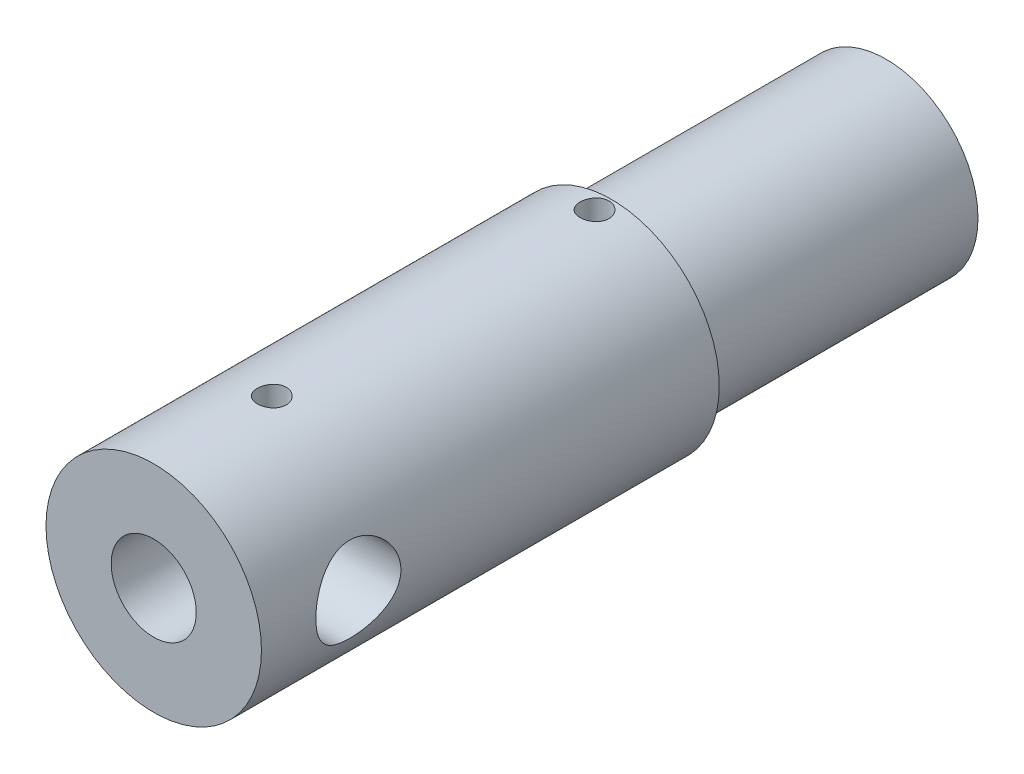
ISO-10303-21;
HEADER;
FILE_DESCRIPTION(('STEP AP214'),'2;1');
FILE_NAME('part.step','',(''),(''),'','','');
FILE_SCHEMA(('AUTOMOTIVE_DESIGN { 1 0 10303 214 1 1 1 1 }'));
ENDSEC;
DATA;
#1=APPLICATION_CONTEXT('core data for automotive mechanical design processes');
#2=APPLICATION_PROTOCOL_DEFINITION('international standard','automotive_design',2000,#1);
#3=PRODUCT_CONTEXT('',#1,'mechanical');
#4=PRODUCT('Part','Part','',(#3));
#5=PRODUCT_RELATED_PRODUCT_CATEGORY('part','',(#4));
#6=PRODUCT_DEFINITION_FORMATION('','',#4);
#7=PRODUCT_DEFINITION_CONTEXT('part definition',#1,'design');
#8=PRODUCT_DEFINITION('design','',#6,#7);
#9=PRODUCT_DEFINITION_SHAPE('','',#8);
#10=(LENGTH_UNIT() NAMED_UNIT(*) SI_UNIT(.MILLI.,.METRE.));
#11=(NAMED_UNIT(*) PLANE_ANGLE_UNIT() SI_UNIT($,.RADIAN.));
#12=(NAMED_UNIT(*) SI_UNIT($,.STERADIAN.) SOLID_ANGLE_UNIT());
#13=UNCERTAINTY_MEASURE_WITH_UNIT(LENGTH_MEASURE(1.E-05),#10,'distance_accuracy_value','');
#14=(GEOMETRIC_REPRESENTATION_CONTEXT(3) GLOBAL_UNCERTAINTY_ASSIGNED_CONTEXT((#13)) GLOBAL_UNIT_ASSIGNED_CONTEXT((#10,
#11,#12)) REPRESENTATION_CONTEXT('',''));
#15=CARTESIAN_POINT('',(0.,0.,0.));
#16=DIRECTION('',(0.,0.,1.));
#17=DIRECTION('',(1.,0.,0.));
#18=AXIS2_PLACEMENT_3D('',#15,#16,#17);
#19=CARTESIAN_POINT('',(0.,0.,77.978));
#20=DIRECTION('',(0.,0.,1.));
#21=DIRECTION('',(1.,0.,0.));
#22=AXIS2_PLACEMENT_3D('',#19,#20,#21);
#23=PLANE('',#22);
#24=CARTESIAN_POINT('',(0.,0.,77.978));
#25=DIRECTION('',(0.,0.,1.));
#26=DIRECTION('',(1.,0.,0.));
#27=AXIS2_PLACEMENT_3D('',#24,#25,#26);
#28=CIRCLE('',#27,2.5908);
#29=CARTESIAN_POINT('',(2.5908,0.,77.978));
#30=VERTEX_POINT('',#29);
#31=EDGE_CURVE('E76',#30,#30,#28,.F.);
#32=ORIENTED_EDGE('',*,*,#31,.T.);
#33=EDGE_LOOP('',(#32));
#34=FACE_BOUND('',#33,.T.);
#35=CARTESIAN_POINT('',(0.,0.,77.978));
#36=DIRECTION('',(0.,0.,1.));
#37=DIRECTION('',(1.,0.,0.));
#38=AXIS2_PLACEMENT_3D('',#35,#36,#37);
#39=CIRCLE('',#38,5.0165);
#40=CARTESIAN_POINT('',(4.318,2.55345809638616,77.978));
#41=VERTEX_POINT('',#40);
#42=CARTESIAN_POINT('',(4.318,-2.55345809638616,77.978));
#43=VERTEX_POINT('',#42);
#44=EDGE_CURVE('E74',#41,#43,#39,.T.);
#45=ORIENTED_EDGE('',*,*,#44,.T.);
#46=DIRECTION('',(0.,1.,0.));
#47=VECTOR('',#46,1.);
#48=CARTESIAN_POINT('',(4.318,0.,77.978));
#49=LINE('',#48,#47);
#50=EDGE_CURVE('E53',#43,#41,#49,.T.);
#51=ORIENTED_EDGE('',*,*,#50,.T.);
#52=EDGE_LOOP('',(#45,#51));
#53=FACE_BOUND('',#52,.T.);
#54=ADVANCED_FACE('F39',(#34,#53),#23,.T.);
#55=CARTESIAN_POINT('',(0.,0.,77.978));
#56=DIRECTION('',(0.,0.,1.));
#57=DIRECTION('',(1.,0.,0.));
#58=AXIS2_PLACEMENT_3D('',#55,#56,#57);
#59=CYLINDRICAL_SURFACE('',#58,5.0165);
#60=CARTESIAN_POINT('',(0.,0.,86.36));
#61=DIRECTION('',(0.,0.,1.));
#62=DIRECTION('',(1.,0.,0.));
#63=AXIS2_PLACEMENT_3D('',#60,#61,#62);
#64=CIRCLE('',#63,5.0165);
#65=CARTESIAN_POINT('',(5.0165,0.,86.36));
#66=VERTEX_POINT('',#65);
#67=EDGE_CURVE('E77',#66,#66,#64,.T.);
#68=ORIENTED_EDGE('',*,*,#67,.T.);
#69=EDGE_LOOP('',(#68));
#70=FACE_BOUND('',#69,.T.);
#71=DIRECTION('',(0.,0.,1.));
#72=VECTOR('',#71,1.);
#73=CARTESIAN_POINT('',(4.318,2.55345809638616,77.978));
#74=LINE('',#73,#72);
#75=CARTESIAN_POINT('',(4.318,2.55345809638616,79.248));
#76=VERTEX_POINT('',#75);
#77=EDGE_CURVE('E12',#76,#41,#74,.F.);
#78=ORIENTED_EDGE('',*,*,#77,.F.);
#79=CARTESIAN_POINT('',(0.,0.,74.93));
#80=DIRECTION('',(-0.707106781186547,0.,0.707106781186547));
#81=DIRECTION('',(0.707106781186547,0.,0.707106781186547));
#82=AXIS2_PLACEMENT_3D('',#79,#80,#81);
#83=ELLIPSE('',#82,7.09440233564463,5.0165);
#84=CARTESIAN_POINT('',(4.318,-2.55345809638616,79.248));
#85=VERTEX_POINT('',#84);
#86=EDGE_CURVE('E47',#76,#85,#83,.F.);
#87=ORIENTED_EDGE('',*,*,#86,.T.);
#88=DIRECTION('',(0.,0.,1.));
#89=VECTOR('',#88,1.);
#90=CARTESIAN_POINT('',(4.318,-2.55345809638616,77.978));
#91=LINE('',#90,#89);
#92=EDGE_CURVE('E68',#43,#85,#91,.T.);
#93=ORIENTED_EDGE('',*,*,#92,.F.);
#94=ORIENTED_EDGE('',*,*,#44,.F.);
#95=EDGE_LOOP('',(#78,#87,#93,#94));
#96=FACE_BOUND('',#95,.T.);
#97=ADVANCED_FACE('F72',(#70,#96),#59,.F.);
#98=CARTESIAN_POINT('',(0.,0.,32.385));
#99=DIRECTION('',(0.,0.,1.));
#100=DIRECTION('',(1.,0.,0.));
#101=AXIS2_PLACEMENT_3D('',#98,#99,#100);
#102=CYLINDRICAL_SURFACE('',#101,2.5908);
#103=CARTESIAN_POINT('',(0.,0.,32.385));
#104=DIRECTION('',(0.,0.,1.));
#105=DIRECTION('',(1.,0.,0.));
#106=AXIS2_PLACEMENT_3D('',#103,#104,#105);
#107=CIRCLE('',#106,2.5908);
#108=CARTESIAN_POINT('',(2.5908,0.,32.385));
#109=VERTEX_POINT('',#108);
#110=EDGE_CURVE('E104',#109,#109,#107,.T.);
#111=ORIENTED_EDGE('',*,*,#110,.F.);
#112=EDGE_LOOP('',(#111));
#113=FACE_BOUND('',#112,.T.);
#114=ORIENTED_EDGE('',*,*,#31,.F.);
#115=EDGE_LOOP('',(#114));
#116=FACE_BOUND('',#115,.T.);
#117=ADVANCED_FACE('F159',(#113,#116),#102,.F.);
#118=CARTESIAN_POINT('',(0.,0.,32.385));
#119=DIRECTION('',(0.,0.,1.));
#120=DIRECTION('',(1.,0.,0.));
#121=AXIS2_PLACEMENT_3D('',#118,#119,#120);
#122=CYLINDRICAL_SURFACE('',#121,12.7);
#123=CARTESIAN_POINT('',(12.7,0.,69.9135));
#124=CARTESIAN_POINT('',(12.6999992536008,0.13503048448745,69.9135009614041));
#125=CARTESIAN_POINT('',(12.6978405753856,0.270104395976051,69.9189591315696));
#126=CARTESIAN_POINT('',(12.6892599223275,0.539295591793623,69.9407428390003));
#127=CARTESIAN_POINT('',(12.6828353124015,0.67341223302513,69.9570750932481));
#128=CARTESIAN_POINT('',(12.6658764229775,0.939911493979719,70.0004870446518));
#129=CARTESIAN_POINT('',(12.6553339413721,1.07229010448549,70.0275881935107));
#130=CARTESIAN_POINT('',(12.6304149298238,1.33413962250543,70.0922791084217));
#131=CARTESIAN_POINT('',(12.6160368447938,1.46360932751278,70.129873128936));
#132=CARTESIAN_POINT('',(12.5838774248287,1.71826450289972,70.2150457777529));
#133=CARTESIAN_POINT('',(12.5661085267484,1.84346371746389,70.2625879777145));
#134=CARTESIAN_POINT('',(12.527583791206,2.08929687505237,70.367326262025));
#135=CARTESIAN_POINT('',(12.5068268392507,2.2099290933668,70.4245259498348));
#136=CARTESIAN_POINT('',(12.4408498773268,2.56370567478687,70.6098833787771));
#137=CARTESIAN_POINT('',(12.3918784987735,2.789072001384,70.7519147724909));
#138=CARTESIAN_POINT('',(12.2864493486917,3.22260269874742,71.0755891670044));
#139=CARTESIAN_POINT('',(12.2297634181477,3.42964579733542,71.2586462644403));
#140=CARTESIAN_POINT('',(12.1163048531114,3.81113867261028,71.6564182315002));
#141=CARTESIAN_POINT('',(12.0595321906568,3.9855733429933,71.8711476917815));
#142=CARTESIAN_POINT('',(11.9777324245386,4.22271910135839,72.2180358712107));
#143=CARTESIAN_POINT('',(11.9504985474465,4.29898840185516,72.3406231738385));
#144=CARTESIAN_POINT('',(11.8985054764321,4.44086326035948,72.592300416476));
#145=CARTESIAN_POINT('',(11.873745268348,4.50647319548944,72.7213876587044));
#146=CARTESIAN_POINT('',(11.8275061275669,4.62647169230084,72.9852514517107));
#147=CARTESIAN_POINT('',(11.8060274510744,4.68085937792449,73.1200284456668));
#148=CARTESIAN_POINT('',(11.7671078653323,4.77785572285879,73.3942582292427));
#149=CARTESIAN_POINT('',(11.7496649495076,4.82047023782937,73.5337086555809));
#150=CARTESIAN_POINT('',(11.7201111457865,4.89187309212192,73.8100407152494));
#151=CARTESIAN_POINT('',(11.7077991996196,4.9211878613799,73.9467648404219));
#152=CARTESIAN_POINT('',(11.6878761479775,4.96832046991476,74.2224619720518));
#153=CARTESIAN_POINT('',(11.6802629336682,4.98614346696528,74.3614339408749));
#154=CARTESIAN_POINT('',(11.6700073788342,5.01009964395918,74.6405376983206));
#155=CARTESIAN_POINT('',(11.6673640501,5.01623514784077,74.7806692508053));
#156=CARTESIAN_POINT('',(11.6671436303611,5.01674802343156,75.0609545377563));
#157=CARTESIAN_POINT('',(11.6695663115474,5.01112592385798,75.2011082709419));
#158=CARTESIAN_POINT('',(11.6790527742275,4.988973487244,75.4707972596317));
#159=CARTESIAN_POINT('',(11.6857905186984,4.97320912151816,75.600407788885));
#160=CARTESIAN_POINT('',(11.7033757942501,4.93168356791329,75.8577754965461));
#161=CARTESIAN_POINT('',(11.7142246806987,4.90591908311105,75.985532049294));
#162=CARTESIAN_POINT('',(11.7396977424385,4.84464618101289,76.238271249177));
#163=CARTESIAN_POINT('',(11.7543209931025,4.80914015002398,76.3632545675549));
#164=CARTESIAN_POINT('',(11.7869092455347,4.72870440981067,76.6097199218765));
#165=CARTESIAN_POINT('',(11.8048755341956,4.68377107071905,76.7312005886153));
#166=CARTESIAN_POINT('',(11.8638164905528,4.53339351098901,77.0940064169721));
#167=CARTESIAN_POINT('',(11.9093135693416,4.41355815234127,77.3288173171724));
#168=CARTESIAN_POINT('',(12.0072935409093,4.13956433449837,77.7757212542931));
#169=CARTESIAN_POINT('',(12.059779012976,3.98539318839366,77.987805850939));
#170=CARTESIAN_POINT('',(12.170639436179,3.63346488347131,78.4001704060331));
#171=CARTESIAN_POINT('',(12.2291604375309,3.43330158347242,78.598362629489));
#172=CARTESIAN_POINT('',(12.3421550086829,3.00179415577912,78.9590805686749));
#173=CARTESIAN_POINT('',(12.3966278105467,2.77044413532291,79.121599528616));
#174=CARTESIAN_POINT('',(12.4714031247705,2.4021484205179,79.3363304308115));
#175=CARTESIAN_POINT('',(12.4953704759313,2.2744895653589,79.4035728164335));
#176=CARTESIAN_POINT('',(12.5400836631636,2.0134045662084,79.5269868654005));
#177=CARTESIAN_POINT('',(12.560830808123,1.87998079377004,79.5831630292449));
#178=CARTESIAN_POINT('',(12.598495695575,1.60832680589454,79.6838981001396));
#179=CARTESIAN_POINT('',(12.6154141506816,1.47009749042226,79.7284591692814));
#180=CARTESIAN_POINT('',(12.6449226380252,1.18986215635633,79.8055112502746));
#181=CARTESIAN_POINT('',(12.6575129613003,1.04785639239573,79.8380030737142));
#182=CARTESIAN_POINT('',(12.6773842984092,0.769573139411074,79.8890182793826));
#183=CARTESIAN_POINT('',(12.6849316156908,0.633443126538986,79.9082444297066));
#184=CARTESIAN_POINT('',(12.6956394034317,0.359841698193786,79.9354660156932));
#185=CARTESIAN_POINT('',(12.6987983751409,0.222369840575187,79.9434576144343));
#186=CARTESIAN_POINT('',(12.7006350071253,-0.0527117567971303,79.9481078237401));
#187=CARTESIAN_POINT('',(12.699315361935,-0.190321363865698,79.9447732486322));
#188=CARTESIAN_POINT('',(12.6922363088026,-0.464738750973862,79.9268192944093));
#189=CARTESIAN_POINT('',(12.6864752717246,-0.601546218224548,79.9121957744216));
#190=CARTESIAN_POINT('',(12.671021142081,-0.867266588995451,79.8727079665361));
#191=CARTESIAN_POINT('',(12.6615123503432,-0.996261866010787,79.848322939382));
#192=CARTESIAN_POINT('',(12.638818515841,-1.25168343225294,79.7896027577262));
#193=CARTESIAN_POINT('',(12.6256321839286,-1.37810880390501,79.7552641138548));
#194=CARTESIAN_POINT('',(12.5959133279431,-1.62749296615406,79.6769585643958));
#195=CARTESIAN_POINT('',(12.5793817675836,-1.7504527435439,79.6329944314794));
#196=CARTESIAN_POINT('',(12.5433611634582,-1.9922451638888,79.5357810722243));
#197=CARTESIAN_POINT('',(12.5238709954937,-2.1110762168474,79.4825283152843));
#198=CARTESIAN_POINT('',(12.4817694064208,-2.34739441214152,79.3654160313193));
#199=CARTESIAN_POINT('',(12.4590818661342,-2.46473419048014,79.3012861423396));
#200=CARTESIAN_POINT('',(12.4116085209067,-2.69363373833508,79.1640801672821));
#201=CARTESIAN_POINT('',(12.386821997482,-2.80519150742784,79.0910010140127));
#202=CARTESIAN_POINT('',(12.3101970218765,-3.13025401295489,78.8590679134451));
#203=CARTESIAN_POINT('',(12.2560671264766,-3.33428806641847,78.6874485216018));
#204=CARTESIAN_POINT('',(12.1433242401447,-3.72473977783418,78.3021731318267));
#205=CARTESIAN_POINT('',(12.0846470372474,-3.90917668038343,78.0865217180456));
#206=CARTESIAN_POINT('',(12.000717919522,-4.15697084863823,77.7415804771113));
#207=CARTESIAN_POINT('',(11.9734067744952,-4.23479855269078,77.6229413355525));
#208=CARTESIAN_POINT('',(11.920946368761,-4.38029795706977,77.3791595141936));
#209=CARTESIAN_POINT('',(11.895796200903,-4.44797392795031,77.2540195990852));
#210=CARTESIAN_POINT('',(11.8482251813727,-4.57319279653029,76.9968392772362));
#211=CARTESIAN_POINT('',(11.8258308828751,-4.63063918546336,76.8647469723126));
#212=CARTESIAN_POINT('',(11.7847972690325,-4.73409456810215,76.5956489410313));
#213=CARTESIAN_POINT('',(11.7661563300392,-4.78010850934163,76.4586453695612));
#214=CARTESIAN_POINT('',(11.7332874496068,-4.8602308023668,76.180733510384));
#215=CARTESIAN_POINT('',(11.7190578609573,-4.89434359867094,76.0398267016182));
#216=CARTESIAN_POINT('',(11.6955360918441,-4.95028895052713,75.7551924125173));
#217=CARTESIAN_POINT('',(11.6862435125655,-4.97212249801338,75.6114651609924));
#218=CARTESIAN_POINT('',(11.6734243377061,-5.00214037338233,75.332635454024));
#219=CARTESIAN_POINT('',(11.6695367604715,-5.01118003365028,75.197641055176));
#220=CARTESIAN_POINT('',(11.6664672663641,-5.01832225045104,74.9272606889649));
#221=CARTESIAN_POINT('',(11.6672869306736,-5.01642113192971,74.7918746052979));
#222=CARTESIAN_POINT('',(11.6736063338292,-5.00169753457514,74.5218769276756));
#223=CARTESIAN_POINT('',(11.6791037602363,-4.98888045201608,74.3872649841229));
#224=CARTESIAN_POINT('',(11.6945899830045,-4.95246959731902,74.1197205292687));
#225=CARTESIAN_POINT('',(11.7045804717972,-4.92887176427091,73.9867886702323));
#226=CARTESIAN_POINT('',(11.7282623076305,-4.87224454225989,73.7286286665559));
#227=CARTESIAN_POINT('',(11.7417982998399,-4.83960837251928,73.6032998941273));
#228=CARTESIAN_POINT('',(11.7723150236578,-4.76489445724339,73.3559046271186));
#229=CARTESIAN_POINT('',(11.7892969537067,-4.72281342639901,73.2338392842668));
#230=CARTESIAN_POINT('',(11.844706681136,-4.58290747369682,72.8736816777407));
#231=CARTESIAN_POINT('',(11.8876167602114,-4.47137805405135,72.641439995734));
#232=CARTESIAN_POINT('',(11.9835134678906,-4.20786121161297,72.1854577473864));
#233=CARTESIAN_POINT('',(12.0369314400725,-4.05394927494923,71.962932228561));
#234=CARTESIAN_POINT('',(12.1465189153345,-3.71269278117946,71.5456616195993));
#235=CARTESIAN_POINT('',(12.2026893853082,-3.52533641379181,71.3509263869438));
#236=CARTESIAN_POINT('',(12.2865170064389,-3.21619623115939,71.077476022316));
#237=CARTESIAN_POINT('',(12.3152139052975,-3.10476823579391,70.9871201414595));
#238=CARTESIAN_POINT('',(12.3710227539155,-2.87433868942282,70.8161206219536));
#239=CARTESIAN_POINT('',(12.3981352776803,-2.75533991429204,70.7354734545547));
#240=CARTESIAN_POINT('',(12.4500401794102,-2.51041515664123,70.5844496985491));
#241=CARTESIAN_POINT('',(12.4748311198499,-2.38448495779846,70.514079458531));
#242=CARTESIAN_POINT('',(12.5213653553715,-2.12663040146104,70.3842841269159));
#243=CARTESIAN_POINT('',(12.5431101249293,-1.99470898520433,70.3248537355628));
#244=CARTESIAN_POINT('',(12.5812415937318,-1.73719180801065,70.2220288202227));
#245=CARTESIAN_POINT('',(12.5979267175975,-1.61201241651583,70.1777002942165));
#246=CARTESIAN_POINT('',(12.6278110139275,-1.3581990084343,70.0990365298976));
#247=CARTESIAN_POINT('',(12.6410117455042,-1.22956656541945,70.0646968213238));
#248=CARTESIAN_POINT('',(12.6635755332546,-0.969947646710468,70.0063693089499));
#249=CARTESIAN_POINT('',(12.6729469625342,-0.83896696792039,69.9823589130556));
#250=CARTESIAN_POINT('',(12.6876471177687,-0.575341313060747,69.9448257205729));
#251=CARTESIAN_POINT('',(12.692978228054,-0.442697365602694,69.9312967384387));
#252=CARTESIAN_POINT('',(12.6974806141507,-0.258169335424374,69.9198810940957));
#253=CARTESIAN_POINT('',(12.6984248323021,-0.206572534077305,69.9174888850343));
#254=CARTESIAN_POINT('',(12.6996846852571,-0.103319276232461,69.9142981103512));
#255=CARTESIAN_POINT('',(12.7000002855732,-0.0516628166172314,69.9134996321657));
#256=CARTESIAN_POINT('',(12.7,0.,69.9135));
#257=B_SPLINE_CURVE_WITH_KNOTS('',3,(#123,#124,#125,#126,#127,#128,#129,#130,#131,#132,#133,
#134,#135,#136,#137,#138,#139,#140,#141,#142,#143,#144,#145,#146,#147,#148,#149,#150,#151,#152,
#153,#154,#155,#156,#157,#158,#159,#160,#161,#162,#163,#164,#165,#166,#167,#168,#169,#170,#171,
#172,#173,#174,#175,#176,#177,#178,#179,#180,#181,#182,#183,#184,#185,#186,#187,#188,#189,#190,
#191,#192,#193,#194,#195,#196,#197,#198,#199,#200,#201,#202,#203,#204,#205,#206,#207,#208,#209,
#210,#211,#212,#213,#214,#215,#216,#217,#218,#219,#220,#221,#222,#223,#224,#225,#226,#227,#228,
#229,#230,#231,#232,#233,#234,#235,#236,#237,#238,#239,#240,#241,#242,#243,#244,#245,#246,#247,
#248,#249,#250,#251,#252,#253,#254,#255,#256),.UNSPECIFIED.,.T.,.F.,(4,2,2,2,2,2,2,2,2,2,2,2,2,
2,2,2,2,2,2,2,2,2,2,2,2,2,2,2,2,2,2,2,2,2,2,2,2,2,2,2,2,2,2,2,2,2,2,2,2,2,2,2,2,2,2,2,2,2,2,2,2,
2,2,2,2,2,4),(0.,0.405039807717073,0.810330043193605,1.21643169938438,1.62269825421455,
2.02750238672916,2.43245789739169,3.24129044274549,4.08412179228614,4.92734263266585,
5.36765523911282,5.80778657770482,6.24795226188249,6.68789862367247,7.1084620191987,
7.52883652449189,7.94912743389469,8.36939944401553,8.76115724495897,9.15304431376262,
9.54483547077036,9.93677775983086,10.7356278928915,11.5347736884223,12.394027669057,
13.2534442347543,13.6917608489123,14.1298988352839,14.5679552061384,15.0059821148601,
15.418521773307,15.8312022916717,16.2436345671651,16.6562181979447,17.0506354143471,
17.4451910663993,17.8396332138726,18.2342256166348,18.6406603882456,19.0472348496288,
19.8599131099134,20.7249289028438,21.1579818097971,21.5908520293499,22.0276115728545,
22.4641817727212,22.9005887591667,23.336960487004,23.7425027389585,24.1481812222306,
24.5536592758861,24.9592901917483,25.3494802211993,25.7398061856302,26.5198849720974,
27.3438889602378,28.1681845078517,28.6066479339644,29.0449515109773,29.4835247156961,
29.9218848933928,30.3229594768781,30.7238542917121,31.1238677625182,31.523644987483,
31.6786051763267,31.8335738664577),.UNSPECIFIED.);
#258=CARTESIAN_POINT('',(12.7,0.,69.9135));
#259=VERTEX_POINT('',#258);
#260=EDGE_CURVE('E83',#259,#259,#257,.T.);
#261=ORIENTED_EDGE('',*,*,#260,.F.);
#262=EDGE_LOOP('',(#261));
#263=FACE_BOUND('',#262,.T.);
#264=CARTESIAN_POINT('',(0.,-12.7,36.5252));
#265=CARTESIAN_POINT('',(-0.131470723283362,-12.6999976260169,36.5252050440883));
#266=CARTESIAN_POINT('',(-0.263007296886344,-12.6979374253399,36.5362128000727));
#267=CARTESIAN_POINT('',(-0.522375137838269,-12.6899174368185,36.5799253930992));
#268=CARTESIAN_POINT('',(-0.65020316038336,-12.6839543355573,36.6126486661324));
#269=CARTESIAN_POINT('',(-0.898365252240633,-12.668795729745,36.6987567454469));
#270=CARTESIAN_POINT('',(-1.01870592945588,-12.6596031244037,36.7521230242933));
#271=CARTESIAN_POINT('',(-1.24871403028647,-12.6389898547231,36.8779499538758));
#272=CARTESIAN_POINT('',(-1.35838234355078,-12.6275693763382,36.9504090111663));
#273=CARTESIAN_POINT('',(-1.56523739454162,-12.6036107222263,37.1132719019799));
#274=CARTESIAN_POINT('',(-1.66228006199182,-12.5910620150613,37.2038571913587));
#275=CARTESIAN_POINT('',(-1.83988292600477,-12.5663395681525,37.4000108059438));
#276=CARTESIAN_POINT('',(-1.92044194995443,-12.5541658551372,37.5055801961847));
#277=CARTESIAN_POINT('',(-2.06338833558353,-12.5314694142275,37.7297213035449));
#278=CARTESIAN_POINT('',(-2.1256294502491,-12.5209602674144,37.848387786115));
#279=CARTESIAN_POINT('',(-2.22923708165895,-12.5029310669165,38.0947209598976));
#280=CARTESIAN_POINT('',(-2.2706053685973,-12.495410759764,38.2223868868335));
#281=CARTESIAN_POINT('',(-2.33083131088181,-12.4843166284702,38.4815544982196));
#282=CARTESIAN_POINT('',(-2.34994003242217,-12.4806988230547,38.6129959194861));
#283=CARTESIAN_POINT('',(-2.3658836479348,-12.4776866830359,38.8772651968406));
#284=CARTESIAN_POINT('',(-2.36272050713734,-12.4782919757937,39.0100929295702));
#285=CARTESIAN_POINT('',(-2.33441383972935,-12.4836175903494,39.2715474241754));
#286=CARTESIAN_POINT('',(-2.30955554182082,-12.4882845112315,39.4002063148812));
#287=CARTESIAN_POINT('',(-2.23901326943651,-12.5011236810141,39.6514950632391));
#288=CARTESIAN_POINT('',(-2.19332842280451,-12.5092960767132,39.7741246681637));
#289=CARTESIAN_POINT('',(-2.08215016344196,-12.5282813375603,40.0107098659524));
#290=CARTESIAN_POINT('',(-2.01654133235,-12.5391095152309,40.1246099408604));
#291=CARTESIAN_POINT('',(-1.86745914918018,-12.5621761145126,40.3398918307476));
#292=CARTESIAN_POINT('',(-1.78398401200845,-12.5744146769845,40.4412723932551));
#293=CARTESIAN_POINT('',(-1.59999971188072,-12.599155899702,40.6302856460977));
#294=CARTESIAN_POINT('',(-1.49924652548026,-12.6116597127417,40.7176808281647));
#295=CARTESIAN_POINT('',(-1.2843833504773,-12.6353481242051,40.8743642613837));
#296=CARTESIAN_POINT('',(-1.17027323198988,-12.6465327097983,40.9436523364382));
#297=CARTESIAN_POINT('',(-0.931689461089225,-12.6663445034897,41.0621886958504));
#298=CARTESIAN_POINT('',(-0.807203400558696,-12.6749685917388,41.1114125598789));
#299=CARTESIAN_POINT('',(-0.551533596086213,-12.6886635176498,41.1881845775469));
#300=CARTESIAN_POINT('',(-0.420350553646903,-12.6937347266566,41.2157349965188));
#301=CARTESIAN_POINT('',(-0.157054240829586,-12.6997015797609,41.2480481341922));
#302=CARTESIAN_POINT('',(-0.0249822211858555,-12.7006568573313,41.2531363226679));
#303=CARTESIAN_POINT('',(0.238125559289691,-12.6984488339636,41.2412532015985));
#304=CARTESIAN_POINT('',(0.369161369882733,-12.6952857320233,41.2242829579041));
#305=CARTESIAN_POINT('',(0.625446807733261,-12.6852334776454,41.1690353008402));
#306=CARTESIAN_POINT('',(0.75073310529031,-12.6783730890633,41.130922305897));
#307=CARTESIAN_POINT('',(0.993137536959243,-12.6616923249807,41.0346487589062));
#308=CARTESIAN_POINT('',(1.11025512277219,-12.6518717510221,40.9764868626935));
#309=CARTESIAN_POINT('',(1.33438849173614,-12.6302112206807,40.8410442605332));
#310=CARTESIAN_POINT('',(1.44128186065872,-12.6183506499399,40.7635643446648));
#311=CARTESIAN_POINT('',(1.64066630719025,-12.593979577545,40.5919549757015));
#312=CARTESIAN_POINT('',(1.73315606140478,-12.5814690163111,40.4978239944131));
#313=CARTESIAN_POINT('',(1.90234228130747,-12.5570105223113,40.2941120719356));
#314=CARTESIAN_POINT('',(1.97881679595141,-12.5450720671833,40.1843454700142));
#315=CARTESIAN_POINT('',(2.11224200386526,-12.5232991984512,39.9533327021754));
#316=CARTESIAN_POINT('',(2.1691934155183,-12.5134647074335,39.8320869588607));
#317=CARTESIAN_POINT('',(2.26163978843019,-12.4970874060826,39.5821254092564));
#318=CARTESIAN_POINT('',(2.29723713680979,-12.4905289139622,39.4534485454159));
#319=CARTESIAN_POINT('',(2.34628118557623,-12.4814100904145,39.1918070540371));
#320=CARTESIAN_POINT('',(2.35973034070327,-12.4788493159117,39.0588429033353));
#321=CARTESIAN_POINT('',(2.36401511720927,-12.4780380888594,38.794623882035));
#322=CARTESIAN_POINT('',(2.35520078325079,-12.4797209143038,38.6633747649691));
#323=CARTESIAN_POINT('',(2.31597443979255,-12.4870594563254,38.4042637289818));
#324=CARTESIAN_POINT('',(2.28556255446225,-12.4927151500616,38.2764017905909));
#325=CARTESIAN_POINT('',(2.20415107728997,-12.5073342811493,38.0278789435496));
#326=CARTESIAN_POINT('',(2.15318880592187,-12.5162917198558,37.9072054338929));
#327=CARTESIAN_POINT('',(2.03216128297529,-12.5365094139954,37.6760654210063));
#328=CARTESIAN_POINT('',(1.96209471159019,-12.5477698285144,37.5655996236749));
#329=CARTESIAN_POINT('',(1.80362810597775,-12.571532162386,37.356256159421));
#330=CARTESIAN_POINT('',(1.71497310340422,-12.5840499325531,37.2575732623034));
#331=CARTESIAN_POINT('',(1.52237839261639,-12.6087973714416,37.0763677386031));
#332=CARTESIAN_POINT('',(1.41843517733029,-12.6210269733092,36.9938488301475));
#333=CARTESIAN_POINT('',(1.1971145082172,-12.6439468163349,36.8466333603409));
#334=CARTESIAN_POINT('',(1.07962643669646,-12.6546224966205,36.7821007666514));
#335=CARTESIAN_POINT('',(0.835315923440114,-12.673089517589,36.6737929867186));
#336=CARTESIAN_POINT('',(0.708502420865043,-12.6808835784135,36.6299982137206));
#337=CARTESIAN_POINT('',(0.484422226859807,-12.6911116364736,36.5733482395267));
#338=CARTESIAN_POINT('',(0.388469224528137,-12.6944260261258,36.555323358366));
#339=CARTESIAN_POINT('',(0.195022868916418,-12.6988710614357,36.5312475157363));
#340=CARTESIAN_POINT('',(0.09752955379351,-12.7000017611032,36.5251962581199));
#341=CARTESIAN_POINT('',(0.,-12.7,36.5252));
#342=B_SPLINE_CURVE_WITH_KNOTS('',3,(#264,#265,#266,#267,#268,#269,#270,#271,#272,#273,#274,
#275,#276,#277,#278,#279,#280,#281,#282,#283,#284,#285,#286,#287,#288,#289,#290,#291,#292,#293,
#294,#295,#296,#297,#298,#299,#300,#301,#302,#303,#304,#305,#306,#307,#308,#309,#310,#311,#312,
#313,#314,#315,#316,#317,#318,#319,#320,#321,#322,#323,#324,#325,#326,#327,#328,#329,#330,#331,
#332,#333,#334,#335,#336,#337,#338,#339,#340,#341),.UNSPECIFIED.,.T.,.F.,(4,2,2,2,2,2,2,2,2,2,2,
2,2,2,2,2,2,2,2,2,2,2,2,2,2,2,2,2,2,2,2,2,2,2,2,2,2,2,4),(0.,0.39405551128335,0.788445995664106,
1.18248332639295,1.57648778195593,1.97465386525316,2.37284826344084,2.77414051918905,
3.17539873620344,3.57208593572358,3.96873813269616,4.36025274452587,4.75178375337291,
5.14562760145563,5.53951081843225,5.93950061437476,6.33949430020486,6.73997337858752,
7.14041059289106,7.53502615875051,7.92962265772447,8.3211927096042,8.71278901914194,
9.10860384469157,9.50445501601196,9.90547416250988,10.3064785512965,10.7055445336872,
11.1045662836098,11.4973534682266,11.8901383946347,12.2822131945858,12.6743150876042,
13.0721955092385,13.4701673462577,13.8716566273306,14.2727659439187,14.5650972539824,
14.857421333637),.UNSPECIFIED.);
#343=CARTESIAN_POINT('',(0.,-12.7,36.5252));
#344=VERTEX_POINT('',#343);
#345=EDGE_CURVE('E122',#344,#344,#342,.T.);
#346=ORIENTED_EDGE('',*,*,#345,.T.);
#347=EDGE_LOOP('',(#346));
#348=FACE_BOUND('',#347,.T.);
#349=CARTESIAN_POINT('',(0.,0.,86.36));
#350=DIRECTION('',(0.,0.,1.));
#351=DIRECTION('',(1.,0.,0.));
#352=AXIS2_PLACEMENT_3D('',#349,#350,#351);
#353=CIRCLE('',#352,12.7);
#354=CARTESIAN_POINT('',(12.7,0.,86.36));
#355=VERTEX_POINT('',#354);
#356=EDGE_CURVE('E107',#355,#355,#353,.T.);
#357=ORIENTED_EDGE('',*,*,#356,.F.);
#358=EDGE_LOOP('',(#357));
#359=FACE_BOUND('',#358,.T.);
#360=CARTESIAN_POINT('',(0.,0.,32.385));
#361=DIRECTION('',(0.,0.,1.));
#362=DIRECTION('',(1.,0.,0.));
#363=AXIS2_PLACEMENT_3D('',#360,#361,#362);
#364=CIRCLE('',#363,12.7);
#365=CARTESIAN_POINT('',(12.7,0.,32.385));
#366=VERTEX_POINT('',#365);
#367=EDGE_CURVE('E110',#366,#366,#364,.T.);
#368=ORIENTED_EDGE('',*,*,#367,.T.);
#369=EDGE_LOOP('',(#368));
#370=FACE_BOUND('',#369,.T.);
#371=CARTESIAN_POINT('',(0.,12.7,74.1426));
#372=CARTESIAN_POINT('',(0.0951336310194011,12.6999985969547,74.1425959956525));
#373=CARTESIAN_POINT('',(0.190325272581297,12.6989197941353,74.1345958834514));
#374=CARTESIAN_POINT('',(0.378055659961366,12.6947200230462,74.1028104434135));
#375=CARTESIAN_POINT('',(0.470591598531488,12.691596971273,74.0790090104799));
#376=CARTESIAN_POINT('',(0.650265940791426,12.6836602368365,74.0163382330351));
#377=CARTESIAN_POINT('',(0.73740808048522,12.6788477401336,73.9774794565315));
#378=CARTESIAN_POINT('',(0.903919008403047,12.6680661821626,73.8858211231478));
#379=CARTESIAN_POINT('',(0.983289040523344,12.6620973064255,73.8330238020944));
#380=CARTESIAN_POINT('',(1.13251746199336,12.6496265211601,73.7146324768284));
#381=CARTESIAN_POINT('',(1.20231989421341,12.6431218047361,73.6489682288778));
#382=CARTESIAN_POINT('',(1.32994945029849,12.6303348637966,73.5068579970954));
#383=CARTESIAN_POINT('',(1.38777593831136,12.6240526511094,73.4304114411487));
#384=CARTESIAN_POINT('',(1.49002391845241,12.6123945652079,73.2685385736671));
#385=CARTESIAN_POINT('',(1.53439237533749,12.6070223137358,73.1830784787396));
#386=CARTESIAN_POINT('',(1.60812606934852,12.597829953958,73.0058358617682));
#387=CARTESIAN_POINT('',(1.63749195897057,12.5940097781506,72.9140536148862));
#388=CARTESIAN_POINT('',(1.68021554339302,12.5883812300033,72.7273557173292));
#389=CARTESIAN_POINT('',(1.69366821266117,12.5865609265701,72.6324621664964));
#390=CARTESIAN_POINT('',(1.70447748452442,12.5851018282329,72.441748271363));
#391=CARTESIAN_POINT('',(1.7018348279214,12.5854629329275,72.3459279699195));
#392=CARTESIAN_POINT('',(1.68060630589827,12.5883149327034,72.1567454934606));
#393=CARTESIAN_POINT('',(1.6621254492058,12.5907917997331,72.0633712935468));
#394=CARTESIAN_POINT('',(1.60990915372806,12.5975743555238,71.881061422969));
#395=CARTESIAN_POINT('',(1.57617336394023,12.6018800863653,71.7921258544864));
#396=CARTESIAN_POINT('',(1.49429321535663,12.6118509931067,71.6208938658901));
#397=CARTESIAN_POINT('',(1.44610361722774,12.617520426093,71.5386193364541));
#398=CARTESIAN_POINT('',(1.3367160897682,12.6295767235644,71.3832849120426));
#399=CARTESIAN_POINT('',(1.27551747730639,12.6359636257172,71.3102255012939));
#400=CARTESIAN_POINT('',(1.14126904612735,12.648797457102,71.174786002115));
#401=CARTESIAN_POINT('',(1.06812879159156,12.6552444595499,71.1124955261456));
#402=CARTESIAN_POINT('',(0.912383564939644,12.667424649556,71.0010611639279));
#403=CARTESIAN_POINT('',(0.8297785650808,12.6731578350218,70.9519173162159));
#404=CARTESIAN_POINT('',(0.657376686561093,12.6832687517705,70.8681696234585));
#405=CARTESIAN_POINT('',(0.567576832470401,12.6876459185927,70.8335718312675));
#406=CARTESIAN_POINT('',(0.38337027754816,12.6945466501357,70.7799717808973));
#407=CARTESIAN_POINT('',(0.288963825083846,12.6970703146717,70.7609686829039));
#408=CARTESIAN_POINT('',(0.0989982736101206,12.6999666377717,70.7392146162044));
#409=CARTESIAN_POINT('',(0.00345354068505654,12.7003556228967,70.7363402868268));
#410=CARTESIAN_POINT('',(-0.186754904397047,12.6989829631784,70.7465991578839));
#411=CARTESIAN_POINT('',(-0.281418638129529,12.6972213711425,70.7597319652632));
#412=CARTESIAN_POINT('',(-0.466810647505024,12.6917556270887,70.8015297957774));
#413=CARTESIAN_POINT('',(-0.557552519934437,12.6880588877041,70.8301355631535));
#414=CARTESIAN_POINT('',(-0.732951533013981,12.6791364498119,70.9020053960915));
#415=CARTESIAN_POINT('',(-0.8176084392632,12.6739106924437,70.9452700259655));
#416=CARTESIAN_POINT('',(-0.978982489148637,12.6624714756331,71.0455248427001));
#417=CARTESIAN_POINT('',(-1.05564997671763,12.6562523846916,71.1025943040327));
#418=CARTESIAN_POINT('',(-1.19836262500995,12.6435386657591,71.2287272501255));
#419=CARTESIAN_POINT('',(-1.2644072981863,12.6370440251388,71.297791285089));
#420=CARTESIAN_POINT('',(-1.38444105332844,12.6244603382634,71.4464983133203));
#421=CARTESIAN_POINT('',(-1.43834804212295,12.6183742385143,71.5262078569845));
#422=CARTESIAN_POINT('',(-1.53200789638778,12.6073464768215,71.6936224361716));
#423=CARTESIAN_POINT('',(-1.57176108054601,12.6024047891111,71.7813272916157));
#424=CARTESIAN_POINT('',(-1.63585388370416,12.5942459051148,71.9619848343426));
#425=CARTESIAN_POINT('',(-1.66023873669,12.5910236523072,72.0549212355147));
#426=CARTESIAN_POINT('',(-1.69304781380783,12.586654344873,72.2436159287909));
#427=CARTESIAN_POINT('',(-1.70147290092187,12.5855071780417,72.3393740680328));
#428=CARTESIAN_POINT('',(-1.7021058559387,12.5854215227346,72.5301768305574));
#429=CARTESIAN_POINT('',(-1.6944427227807,12.5864654654361,72.6252210435925));
#430=CARTESIAN_POINT('',(-1.66339104498833,12.5906064930726,72.8126570775232));
#431=CARTESIAN_POINT('',(-1.64000250690971,12.5937035771516,72.9050488995247));
#432=CARTESIAN_POINT('',(-1.57820610436615,12.6015962492343,73.0845340857623));
#433=CARTESIAN_POINT('',(-1.53980541685334,12.6063910255085,73.1716299589084));
#434=CARTESIAN_POINT('',(-1.4490874492174,12.617140040696,73.3381630257173));
#435=CARTESIAN_POINT('',(-1.39676989262973,12.6230943026425,73.4176000671914));
#436=CARTESIAN_POINT('',(-1.27922790420893,12.6355484923648,73.5672187237257));
#437=CARTESIAN_POINT('',(-1.21390749523517,12.6420522573366,73.6373246252493));
#438=CARTESIAN_POINT('',(-1.07241569430746,12.6548393751952,73.7656280341309));
#439=CARTESIAN_POINT('',(-0.996241761426591,12.6611226760385,73.8238227451557));
#440=CARTESIAN_POINT('',(-0.834819844633176,12.6727916183057,73.9268723305826));
#441=CARTESIAN_POINT('',(-0.749533715750585,12.6781732230773,73.9716678874033));
#442=CARTESIAN_POINT('',(-0.572621978205437,12.6873921045843,74.0462352408424));
#443=CARTESIAN_POINT('',(-0.481003269061661,12.6912310319678,74.0760231042404));
#444=CARTESIAN_POINT('',(-0.324109211073689,12.6960231456571,74.1127247115053));
#445=CARTESIAN_POINT('',(-0.259816621166025,12.697507068394,74.1239115025309));
#446=CARTESIAN_POINT('',(-0.130358429619018,12.6994959719235,74.1388504855653));
#447=CARTESIAN_POINT('',(-0.0651928357950032,12.7000009614739,74.142602744085));
#448=CARTESIAN_POINT('',(0.,12.7,74.1426));
#449=B_SPLINE_CURVE_WITH_KNOTS('',3,(#371,#372,#373,#374,#375,#376,#377,#378,#379,#380,#381,
#382,#383,#384,#385,#386,#387,#388,#389,#390,#391,#392,#393,#394,#395,#396,#397,#398,#399,#400,
#401,#402,#403,#404,#405,#406,#407,#408,#409,#410,#411,#412,#413,#414,#415,#416,#417,#418,#419,
#420,#421,#422,#423,#424,#425,#426,#427,#428,#429,#430,#431,#432,#433,#434,#435,#436,#437,#438,
#439,#440,#441,#442,#443,#444,#445,#446,#447,#448),.UNSPECIFIED.,.T.,.F.,(4,2,2,2,2,2,2,2,2,2,2,
2,2,2,2,2,2,2,2,2,2,2,2,2,2,2,2,2,2,2,2,2,2,2,2,2,2,2,4),(0.,0.285162733540729,
0.570616559124401,0.855870400558109,1.14107851332481,1.42788935429633,1.71471541933397,
2.0026575435945,2.29058714352478,2.5767894882378,2.86297866032927,3.14728492267532,
3.43159772699066,3.7168098636072,4.00203698102469,4.28953392569126,4.57703171308012,
4.86464901493348,5.15225082684233,5.4376498903395,5.72304194599769,6.00734871400006,
6.29166642801072,6.57765730794327,6.86366131003199,7.15154518001085,7.43942256756954,
7.72644863209542,8.01345917600455,8.29817719780607,8.58289510091181,8.86747705328124,
9.15206465941474,9.43883644418901,9.72567547597668,10.0137661541019,10.3015477522458,
10.4969648027752,10.6923801050544),.UNSPECIFIED.);
#450=CARTESIAN_POINT('',(0.,12.7,74.1426));
#451=VERTEX_POINT('',#450);
#452=EDGE_CURVE('E129',#451,#451,#449,.T.);
#453=ORIENTED_EDGE('',*,*,#452,.F.);
#454=EDGE_LOOP('',(#453));
#455=FACE_BOUND('',#454,.T.);
#456=CARTESIAN_POINT('',(0.,12.7,36.0934));
#457=CARTESIAN_POINT('',(-0.0951336310194013,12.6999985969547,36.0933959956525));
#458=CARTESIAN_POINT('',(-0.190325272581298,12.6989197941353,36.0853958834514));
#459=CARTESIAN_POINT('',(-0.378055659961367,12.6947200230462,36.0536104434135));
#460=CARTESIAN_POINT('',(-0.47059159853149,12.691596971273,36.0298090104799));
#461=CARTESIAN_POINT('',(-0.65026594079143,12.6836602368365,35.9671382330351));
#462=CARTESIAN_POINT('',(-0.737408080485225,12.6788477401336,35.9282794565315));
#463=CARTESIAN_POINT('',(-0.903919008403052,12.6680661821626,35.8366211231478));
#464=CARTESIAN_POINT('',(-0.983289040523349,12.6620973064255,35.7838238020944));
#465=CARTESIAN_POINT('',(-1.13251746199337,12.6496265211601,35.6654324768284));
#466=CARTESIAN_POINT('',(-1.20231989421341,12.6431218047361,35.5997682288778));
#467=CARTESIAN_POINT('',(-1.32994945029849,12.6303348637966,35.4576579970954));
#468=CARTESIAN_POINT('',(-1.38777593831136,12.6240526511094,35.3812114411487));
#469=CARTESIAN_POINT('',(-1.49002391845242,12.6123945652079,35.2193385736671));
#470=CARTESIAN_POINT('',(-1.53439237533749,12.6070223137358,35.1338784787396));
#471=CARTESIAN_POINT('',(-1.60812606934852,12.597829953958,34.9566358617682));
#472=CARTESIAN_POINT('',(-1.63749195897057,12.5940097781506,34.8648536148862));
#473=CARTESIAN_POINT('',(-1.68021554339302,12.5883812300033,34.6781557173292));
#474=CARTESIAN_POINT('',(-1.69366821266117,12.5865609265701,34.5832621664964));
#475=CARTESIAN_POINT('',(-1.70447748452442,12.5851018282329,34.392548271363));
#476=CARTESIAN_POINT('',(-1.70183482792141,12.5854629329275,34.2967279699195));
#477=CARTESIAN_POINT('',(-1.68060630589826,12.5883149327034,34.1075454934606));
#478=CARTESIAN_POINT('',(-1.6621254492058,12.5907917997331,34.0141712935468));
#479=CARTESIAN_POINT('',(-1.60990915372806,12.5975743555238,33.831861422969));
#480=CARTESIAN_POINT('',(-1.57617336394023,12.6018800863653,33.7429258544864));
#481=CARTESIAN_POINT('',(-1.49429321535663,12.6118509931067,33.5716938658901));
#482=CARTESIAN_POINT('',(-1.44610361722774,12.617520426093,33.4894193364541));
#483=CARTESIAN_POINT('',(-1.3367160897682,12.6295767235644,33.3340849120426));
#484=CARTESIAN_POINT('',(-1.27551747730638,12.6359636257172,33.2610255012939));
#485=CARTESIAN_POINT('',(-1.14126904612735,12.648797457102,33.125586002115));
#486=CARTESIAN_POINT('',(-1.06812879159156,12.6552444595499,33.0632955261456));
#487=CARTESIAN_POINT('',(-0.912383564939648,12.667424649556,32.9518611639279));
#488=CARTESIAN_POINT('',(-0.829778565080808,12.6731578350218,32.9027173162159));
#489=CARTESIAN_POINT('',(-0.657376686561103,12.6832687517705,32.8189696234585));
#490=CARTESIAN_POINT('',(-0.567576832470408,12.6876459185927,32.7843718312675));
#491=CARTESIAN_POINT('',(-0.383370277548162,12.6945466501357,32.7307717808973));
#492=CARTESIAN_POINT('',(-0.288963825083846,12.6970703146717,32.7117686829039));
#493=CARTESIAN_POINT('',(-0.0989982736101185,12.6999666377717,32.6900146162044));
#494=CARTESIAN_POINT('',(-0.00345354068505456,12.7003556228967,32.6871402868268));
#495=CARTESIAN_POINT('',(0.186754904397049,12.6989829631784,32.6973991578839));
#496=CARTESIAN_POINT('',(0.28141863812953,12.6972213711425,32.7105319652632));
#497=CARTESIAN_POINT('',(0.466810647505025,12.6917556270887,32.7523297957773));
#498=CARTESIAN_POINT('',(0.557552519934438,12.6880588877041,32.7809355631535));
#499=CARTESIAN_POINT('',(0.732951533013981,12.6791364498119,32.8528053960915));
#500=CARTESIAN_POINT('',(0.8176084392632,12.6739106924437,32.8960700259655));
#501=CARTESIAN_POINT('',(0.978982489148638,12.6624714756331,32.9963248427001));
#502=CARTESIAN_POINT('',(1.05564997671763,12.6562523846916,33.0533943040327));
#503=CARTESIAN_POINT('',(1.19836262500995,12.6435386657591,33.1795272501255));
#504=CARTESIAN_POINT('',(1.2644072981863,12.6370440251388,33.248591285089));
#505=CARTESIAN_POINT('',(1.38444105332844,12.6244603382634,33.3972983133203));
#506=CARTESIAN_POINT('',(1.43834804212294,12.6183742385143,33.4770078569845));
#507=CARTESIAN_POINT('',(1.53200789638778,12.6073464768215,33.6444224361716));
#508=CARTESIAN_POINT('',(1.571761080546,12.6024047891111,33.7321272916156));
#509=CARTESIAN_POINT('',(1.63585388370416,12.5942459051148,33.9127848343426));
#510=CARTESIAN_POINT('',(1.66023873669,12.5910236523072,34.0057212355147));
#511=CARTESIAN_POINT('',(1.69304781380783,12.586654344873,34.1944159287909));
#512=CARTESIAN_POINT('',(1.70147290092187,12.5855071780417,34.2901740680328));
#513=CARTESIAN_POINT('',(1.7021058559387,12.5854215227346,34.4809768305574));
#514=CARTESIAN_POINT('',(1.6944427227807,12.5864654654361,34.5760210435925));
#515=CARTESIAN_POINT('',(1.66339104498833,12.5906064930726,34.7634570775232));
#516=CARTESIAN_POINT('',(1.64000250690971,12.5937035771516,34.8558488995247));
#517=CARTESIAN_POINT('',(1.57820610436615,12.6015962492343,35.0353340857623));
#518=CARTESIAN_POINT('',(1.53980541685335,12.6063910255085,35.1224299589084));
#519=CARTESIAN_POINT('',(1.4490874492174,12.617140040696,35.2889630257173));
#520=CARTESIAN_POINT('',(1.39676989262972,12.6230943026425,35.3684000671914));
#521=CARTESIAN_POINT('',(1.27922790420892,12.6355484923648,35.5180187237257));
#522=CARTESIAN_POINT('',(1.21390749523517,12.6420522573366,35.5881246252493));
#523=CARTESIAN_POINT('',(1.07241569430746,12.6548393751952,35.7164280341309));
#524=CARTESIAN_POINT('',(0.996241761426591,12.6611226760385,35.7746227451557));
#525=CARTESIAN_POINT('',(0.834819844633178,12.6727916183057,35.8776723305826));
#526=CARTESIAN_POINT('',(0.749533715750587,12.6781732230773,35.9224678874033));
#527=CARTESIAN_POINT('',(0.572621978205438,12.6873921045843,35.9970352408425));
#528=CARTESIAN_POINT('',(0.481003269061661,12.6912310319678,36.0268231042404));
#529=CARTESIAN_POINT('',(0.324109211073688,12.6960231456571,36.0635247115053));
#530=CARTESIAN_POINT('',(0.259816621166026,12.697507068394,36.0747115025309));
#531=CARTESIAN_POINT('',(0.130358429619019,12.6994959719235,36.0896504855653));
#532=CARTESIAN_POINT('',(0.0651928357950035,12.7000009614739,36.093402744085));
#533=CARTESIAN_POINT('',(0.,12.7,36.0934));
#534=B_SPLINE_CURVE_WITH_KNOTS('',3,(#456,#457,#458,#459,#460,#461,#462,#463,#464,#465,#466,
#467,#468,#469,#470,#471,#472,#473,#474,#475,#476,#477,#478,#479,#480,#481,#482,#483,#484,#485,
#486,#487,#488,#489,#490,#491,#492,#493,#494,#495,#496,#497,#498,#499,#500,#501,#502,#503,#504,
#505,#506,#507,#508,#509,#510,#511,#512,#513,#514,#515,#516,#517,#518,#519,#520,#521,#522,#523,
#524,#525,#526,#527,#528,#529,#530,#531,#532,#533),.UNSPECIFIED.,.T.,.F.,(4,2,2,2,2,2,2,2,2,2,2,
2,2,2,2,2,2,2,2,2,2,2,2,2,2,2,2,2,2,2,2,2,2,2,2,2,2,2,4),(0.,0.285162733540729,
0.570616559124403,0.855870400558117,1.14107851332481,1.42788935429633,1.71471541933397,
2.0026575435945,2.29058714352479,2.57678948823781,2.86297866032928,3.14728492267535,
3.43159772699067,3.71680986360722,4.0020369810247,4.28953392569126,4.57703171308011,
4.86464901493348,5.15225082684234,5.43764989033951,5.7230419459977,6.00734871400007,
6.29166642801073,6.57765730794328,6.863661310032,7.15154518001084,7.43942256756955,
7.72644863209542,8.01345917600455,8.29817719780607,8.58289510091182,8.86747705328125,
9.15206465941476,9.43883644418903,9.72567547597669,10.0137661541019,10.3015477522458,
10.4969648027752,10.6923801050544),.UNSPECIFIED.);
#535=CARTESIAN_POINT('',(0.,12.7,36.0934));
#536=VERTEX_POINT('',#535);
#537=EDGE_CURVE('E194',#536,#536,#534,.T.);
#538=ORIENTED_EDGE('',*,*,#537,.T.);
#539=EDGE_LOOP('',(#538));
#540=FACE_BOUND('',#539,.T.);
#541=ADVANCED_FACE('F134',(#263,#348,#359,#370,#455,#540),#122,.T.);
#542=CARTESIAN_POINT('',(0.,0.,35.3822));
#543=DIRECTION('',(0.,0.,-1.));
#544=DIRECTION('',(-1.,0.,0.));
#545=AXIS2_PLACEMENT_3D('',#542,#543,#544);
#546=CYLINDRICAL_SURFACE('',#545,6.5151);
#547=CARTESIAN_POINT('',(0.,0.,32.385));
#548=DIRECTION('',(0.,0.,1.));
#549=DIRECTION('',(1.,0.,0.));
#550=AXIS2_PLACEMENT_3D('',#547,#548,#549);
#551=CIRCLE('',#550,6.5151);
#552=CARTESIAN_POINT('',(6.5151,0.,32.385));
#553=VERTEX_POINT('',#552);
#554=EDGE_CURVE('E119',#553,#553,#551,.T.);
#555=ORIENTED_EDGE('',*,*,#554,.T.);
#556=EDGE_LOOP('',(#555));
#557=FACE_BOUND('',#556,.T.);
#558=CARTESIAN_POINT('',(0.,0.,2.3876));
#559=DIRECTION('',(0.,0.,-1.));
#560=DIRECTION('',(-1.,0.,0.));
#561=AXIS2_PLACEMENT_3D('',#558,#559,#560);
#562=CIRCLE('',#561,6.5151);
#563=CARTESIAN_POINT('',(-6.5151,0.,2.3876));
#564=VERTEX_POINT('',#563);
#565=EDGE_CURVE('E95',#564,#564,#562,.T.);
#566=ORIENTED_EDGE('',*,*,#565,.T.);
#567=EDGE_LOOP('',(#566));
#568=FACE_BOUND('',#567,.T.);
#569=ADVANCED_FACE('F154',(#557,#568),#546,.F.);
#570=CARTESIAN_POINT('',(0.,0.,32.385));
#571=DIRECTION('',(0.,0.,1.));
#572=DIRECTION('',(1.,0.,0.));
#573=AXIS2_PLACEMENT_3D('',#570,#571,#572);
#574=PLANE('',#573);
#575=ORIENTED_EDGE('',*,*,#110,.T.);
#576=EDGE_LOOP('',(#575));
#577=FACE_BOUND('',#576,.T.);
#578=ORIENTED_EDGE('',*,*,#554,.F.);
#579=EDGE_LOOP('',(#578));
#580=FACE_BOUND('',#579,.T.);
#581=ADVANCED_FACE('F157',(#577,#580),#574,.F.);
#582=CARTESIAN_POINT('',(0.,0.,86.36));
#583=DIRECTION('',(0.,0.,-1.));
#584=DIRECTION('',(-1.,0.,0.));
#585=AXIS2_PLACEMENT_3D('',#582,#583,#584);
#586=CYLINDRICAL_SURFACE('',#585,10.8204);
#587=CARTESIAN_POINT('',(0.,0.,0.));
#588=DIRECTION('',(0.,0.,1.));
#589=DIRECTION('',(1.,0.,0.));
#590=AXIS2_PLACEMENT_3D('',#587,#588,#589);
#591=CIRCLE('',#590,10.8204);
#592=CARTESIAN_POINT('',(10.8204,0.,0.));
#593=VERTEX_POINT('',#592);
#594=EDGE_CURVE('E113',#593,#593,#591,.T.);
#595=ORIENTED_EDGE('',*,*,#594,.T.);
#596=EDGE_LOOP('',(#595));
#597=FACE_BOUND('',#596,.T.);
#598=CARTESIAN_POINT('',(0.,0.,32.385));
#599=DIRECTION('',(0.,0.,1.));
#600=DIRECTION('',(1.,0.,0.));
#601=AXIS2_PLACEMENT_3D('',#598,#599,#600);
#602=CIRCLE('',#601,10.8204);
#603=CARTESIAN_POINT('',(10.8204,0.,32.385));
#604=VERTEX_POINT('',#603);
#605=EDGE_CURVE('E116',#604,#604,#602,.T.);
#606=ORIENTED_EDGE('',*,*,#605,.F.);
#607=EDGE_LOOP('',(#606));
#608=FACE_BOUND('',#607,.T.);
#609=ADVANCED_FACE('F41',(#597,#608),#586,.T.);
#610=CARTESIAN_POINT('',(0.,-23.9463013562373,0.));
#611=DIRECTION('',(0.,0.,1.));
#612=DIRECTION('',(1.,0.,0.));
#613=AXIS2_PLACEMENT_3D('',#610,#611,#612);
#614=PLANE('',#613);
#615=CARTESIAN_POINT('',(0.,0.,0.));
#616=DIRECTION('',(0.,0.,-1.));
#617=DIRECTION('',(-1.,0.,0.));
#618=AXIS2_PLACEMENT_3D('',#615,#616,#617);
#619=CIRCLE('',#618,8.7122);
#620=CARTESIAN_POINT('',(-8.7122,0.,0.));
#621=VERTEX_POINT('',#620);
#622=EDGE_CURVE('E98',#621,#621,#619,.T.);
#623=ORIENTED_EDGE('',*,*,#622,.F.);
#624=EDGE_LOOP('',(#623));
#625=FACE_BOUND('',#624,.T.);
#626=ORIENTED_EDGE('',*,*,#594,.F.);
#627=EDGE_LOOP('',(#626));
#628=FACE_BOUND('',#627,.T.);
#629=ADVANCED_FACE('F169',(#625,#628),#614,.F.);
#630=ORIENTED_EDGE('',*,*,#367,.F.);
#631=EDGE_LOOP('',(#630));
#632=FACE_BOUND('',#631,.T.);
#633=ORIENTED_EDGE('',*,*,#605,.T.);
#634=EDGE_LOOP('',(#633));
#635=FACE_BOUND('',#634,.T.);
#636=ADVANCED_FACE('F164',(#632,#635),#574,.F.);
#637=CARTESIAN_POINT('',(0.,-23.9463013562373,86.36));
#638=DIRECTION('',(0.,0.,1.));
#639=DIRECTION('',(1.,0.,0.));
#640=AXIS2_PLACEMENT_3D('',#637,#638,#639);
#641=PLANE('',#640);
#642=ORIENTED_EDGE('',*,*,#67,.F.);
#643=EDGE_LOOP('',(#642));
#644=FACE_BOUND('',#643,.T.);
#645=ORIENTED_EDGE('',*,*,#356,.T.);
#646=EDGE_LOOP('',(#645));
#647=FACE_BOUND('',#646,.T.);
#648=ADVANCED_FACE('F152',(#644,#647),#641,.T.);
#649=CARTESIAN_POINT('',(0.,0.,2.3876));
#650=DIRECTION('',(0.,0.,-1.));
#651=DIRECTION('',(-1.,0.,0.));
#652=AXIS2_PLACEMENT_3D('',#649,#650,#651);
#653=CYLINDRICAL_SURFACE('',#652,8.7122);
#654=CARTESIAN_POINT('',(0.,0.,2.3876));
#655=DIRECTION('',(0.,0.,-1.));
#656=DIRECTION('',(-1.,0.,0.));
#657=AXIS2_PLACEMENT_3D('',#654,#655,#656);
#658=CIRCLE('',#657,8.7122);
#659=CARTESIAN_POINT('',(-8.7122,0.,2.3876));
#660=VERTEX_POINT('',#659);
#661=EDGE_CURVE('E101',#660,#660,#658,.T.);
#662=ORIENTED_EDGE('',*,*,#661,.F.);
#663=EDGE_LOOP('',(#662));
#664=FACE_BOUND('',#663,.T.);
#665=ORIENTED_EDGE('',*,*,#622,.T.);
#666=EDGE_LOOP('',(#665));
#667=FACE_BOUND('',#666,.T.);
#668=ADVANCED_FACE('F148',(#664,#667),#653,.F.);
#669=CARTESIAN_POINT('',(0.,0.,2.3876));
#670=DIRECTION('',(0.,0.,-1.));
#671=DIRECTION('',(-1.,0.,0.));
#672=AXIS2_PLACEMENT_3D('',#669,#670,#671);
#673=PLANE('',#672);
#674=ORIENTED_EDGE('',*,*,#565,.F.);
#675=EDGE_LOOP('',(#674));
#676=FACE_BOUND('',#675,.T.);
#677=ORIENTED_EDGE('',*,*,#661,.T.);
#678=EDGE_LOOP('',(#677));
#679=FACE_BOUND('',#678,.T.);
#680=ADVANCED_FACE('F144',(#676,#679),#673,.T.);
#681=CARTESIAN_POINT('',(0.,-5.4356,38.8874));
#682=DIRECTION('',(0.,-1.,0.));
#683=DIRECTION('',(0.,0.,-1.));
#684=AXIS2_PLACEMENT_3D('',#681,#682,#683);
#685=CYLINDRICAL_SURFACE('',#684,2.3622);
#686=CARTESIAN_POINT('',(0.,-5.4356,38.8874));
#687=DIRECTION('',(0.,1.,0.));
#688=DIRECTION('',(-1.,0.,0.));
#689=AXIS2_PLACEMENT_3D('',#686,#687,#688);
#690=CIRCLE('',#689,2.3622);
#691=CARTESIAN_POINT('',(-2.3622,-5.4356,38.8874));
#692=VERTEX_POINT('',#691);
#693=EDGE_CURVE('E92',#692,#692,#690,.T.);
#694=ORIENTED_EDGE('',*,*,#693,.T.);
#695=EDGE_LOOP('',(#694));
#696=FACE_BOUND('',#695,.T.);
#697=ORIENTED_EDGE('',*,*,#345,.F.);
#698=EDGE_LOOP('',(#697));
#699=FACE_BOUND('',#698,.T.);
#700=ADVANCED_FACE('F138',(#696,#699),#685,.F.);
#701=CARTESIAN_POINT('',(0.,-5.4356,38.8874));
#702=DIRECTION('',(0.,1.,0.));
#703=DIRECTION('',(-1.,0.,0.));
#704=AXIS2_PLACEMENT_3D('',#701,#702,#703);
#705=PLANE('',#704);
#706=ORIENTED_EDGE('',*,*,#693,.F.);
#707=EDGE_LOOP('',(#706));
#708=FACE_BOUND('',#707,.T.);
#709=ADVANCED_FACE('F143',(#708),#705,.F.);
#710=CARTESIAN_POINT('',(0.,8.128,72.4408));
#711=DIRECTION('',(0.,1.,0.));
#712=DIRECTION('',(0.,0.,1.));
#713=AXIS2_PLACEMENT_3D('',#710,#711,#712);
#714=CYLINDRICAL_SURFACE('',#713,1.7018);
#715=ORIENTED_EDGE('',*,*,#452,.T.);
#716=EDGE_LOOP('',(#715));
#717=FACE_BOUND('',#716,.T.);
#718=CARTESIAN_POINT('',(0.,8.128,72.4408));
#719=DIRECTION('',(0.,1.,0.));
#720=DIRECTION('',(-1.,0.,0.));
#721=AXIS2_PLACEMENT_3D('',#718,#719,#720);
#722=CIRCLE('',#721,1.7018);
#723=CARTESIAN_POINT('',(-1.7018,8.128,72.4408));
#724=VERTEX_POINT('',#723);
#725=EDGE_CURVE('E89',#724,#724,#722,.T.);
#726=ORIENTED_EDGE('',*,*,#725,.F.);
#727=EDGE_LOOP('',(#726));
#728=FACE_BOUND('',#727,.T.);
#729=ADVANCED_FACE('F204',(#717,#728),#714,.F.);
#730=CARTESIAN_POINT('',(0.,8.128,72.4408));
#731=DIRECTION('',(0.,1.,0.));
#732=DIRECTION('',(-1.,0.,0.));
#733=AXIS2_PLACEMENT_3D('',#730,#731,#732);
#734=PLANE('',#733);
#735=ORIENTED_EDGE('',*,*,#725,.T.);
#736=EDGE_LOOP('',(#735));
#737=FACE_BOUND('',#736,.T.);
#738=ADVANCED_FACE('F191',(#737),#734,.T.);
#739=CARTESIAN_POINT('',(0.,8.128,34.3916));
#740=DIRECTION('',(0.,1.,0.));
#741=DIRECTION('',(0.,0.,1.));
#742=AXIS2_PLACEMENT_3D('',#739,#740,#741);
#743=CYLINDRICAL_SURFACE('',#742,1.7018);
#744=ORIENTED_EDGE('',*,*,#537,.F.);
#745=EDGE_LOOP('',(#744));
#746=FACE_BOUND('',#745,.T.);
#747=CARTESIAN_POINT('',(0.,8.128,34.3916));
#748=DIRECTION('',(0.,1.,0.));
#749=DIRECTION('',(-1.,0.,0.));
#750=AXIS2_PLACEMENT_3D('',#747,#748,#749);
#751=CIRCLE('',#750,1.7018);
#752=CARTESIAN_POINT('',(-1.7018,8.128,34.3916));
#753=VERTEX_POINT('',#752);
#754=EDGE_CURVE('E80',#753,#753,#751,.T.);
#755=ORIENTED_EDGE('',*,*,#754,.F.);
#756=EDGE_LOOP('',(#755));
#757=FACE_BOUND('',#756,.T.);
#758=ADVANCED_FACE('F186',(#746,#757),#743,.F.);
#759=CARTESIAN_POINT('',(0.,8.128,-20.9353660420503));
#760=DIRECTION('',(0.,-1.,0.));
#761=DIRECTION('',(0.,0.,-1.));
#762=AXIS2_PLACEMENT_3D('',#759,#760,#761);
#763=PLANE('',#762);
#764=ORIENTED_EDGE('',*,*,#754,.T.);
#765=EDGE_LOOP('',(#764));
#766=FACE_BOUND('',#765,.T.);
#767=ADVANCED_FACE('F190',(#766),#763,.F.);
#768=CARTESIAN_POINT('',(4.318,0.,74.93));
#769=DIRECTION('',(1.,0.,0.));
#770=DIRECTION('',(0.,0.,-1.));
#771=AXIS2_PLACEMENT_3D('',#768,#769,#770);
#772=CYLINDRICAL_SURFACE('',#771,5.0165);
#773=ORIENTED_EDGE('',*,*,#260,.T.);
#774=EDGE_LOOP('',(#773));
#775=FACE_BOUND('',#774,.T.);
#776=CARTESIAN_POINT('',(4.318,0.,74.93));
#777=DIRECTION('',(1.,0.,0.));
#778=DIRECTION('',(0.,0.,-1.));
#779=AXIS2_PLACEMENT_3D('',#776,#777,#778);
#780=CIRCLE('',#779,5.0165);
#781=EDGE_CURVE('E66',#85,#76,#780,.T.);
#782=ORIENTED_EDGE('',*,*,#781,.F.);
#783=ORIENTED_EDGE('',*,*,#86,.F.);
#784=EDGE_LOOP('',(#782,#783));
#785=FACE_BOUND('',#784,.T.);
#786=ADVANCED_FACE('F65',(#775,#785),#772,.F.);
#787=CARTESIAN_POINT('',(4.318,0.,-22.9292324141538));
#788=DIRECTION('',(1.,0.,0.));
#789=DIRECTION('',(0.,0.,-1.));
#790=AXIS2_PLACEMENT_3D('',#787,#788,#789);
#791=PLANE('',#790);
#792=ORIENTED_EDGE('',*,*,#77,.T.);
#793=ORIENTED_EDGE('',*,*,#50,.F.);
#794=ORIENTED_EDGE('',*,*,#92,.T.);
#795=ORIENTED_EDGE('',*,*,#781,.T.);
#796=EDGE_LOOP('',(#792,#793,#794,#795));
#797=FACE_BOUND('',#796,.T.);
#798=ADVANCED_FACE('F69',(#797),#791,.T.);
#799=CLOSED_SHELL('',(#54,#97,#117,#541,#569,#581,#609,#629,#636,#648,#668,#680,#700,#709,#729,
#738,#758,#767,#786,#798));
#800=MANIFOLD_SOLID_BREP('B2',#799);
#801=ADVANCED_BREP_SHAPE_REPRESENTATION('',(#18,#800),#14);
#802=SHAPE_DEFINITION_REPRESENTATION(#9,#801);
ENDSEC;
END-ISO-10303-21;
